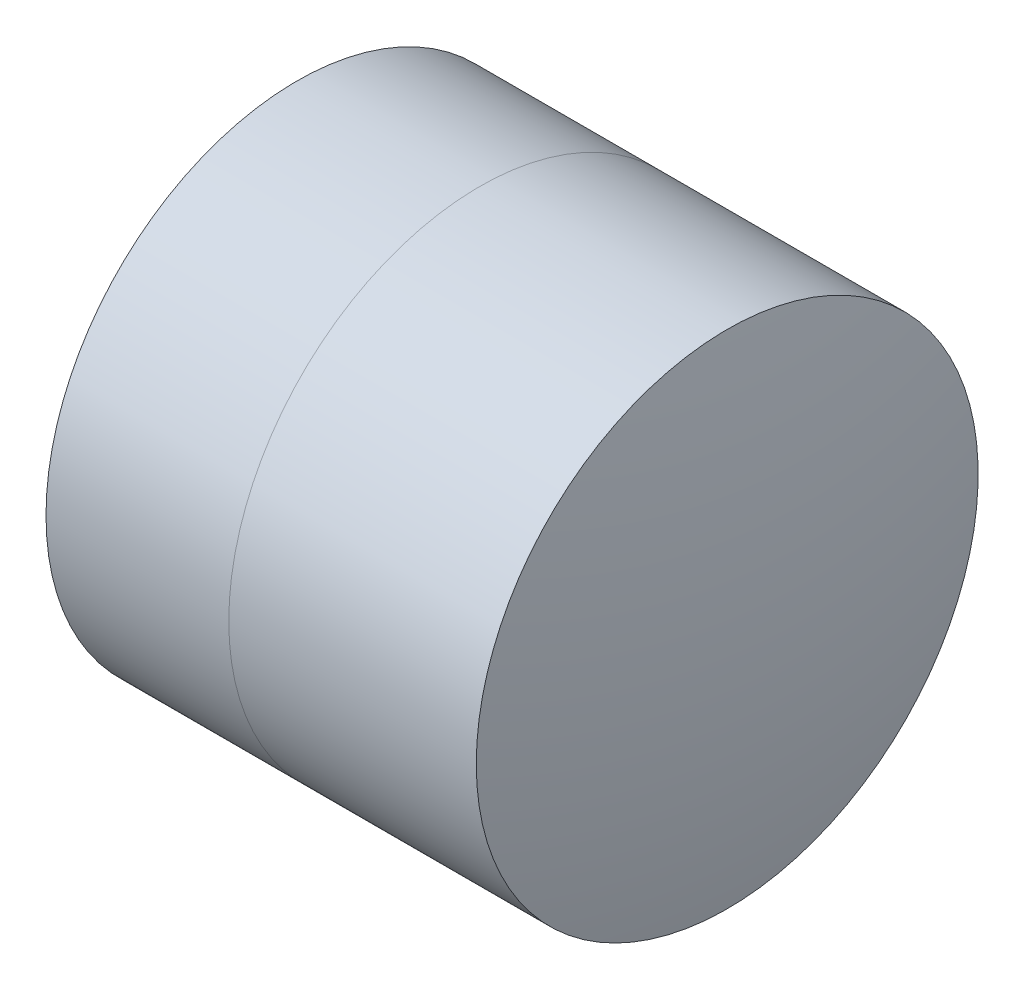
ISO-10303-21;
HEADER;
FILE_DESCRIPTION(('STEP AP214'),'2;1');
FILE_NAME('part.step','',(''),(''),'','','');
FILE_SCHEMA(('AUTOMOTIVE_DESIGN { 1 0 10303 214 1 1 1 1 }'));
ENDSEC;
DATA;
#1=APPLICATION_CONTEXT('core data for automotive mechanical design processes');
#2=APPLICATION_PROTOCOL_DEFINITION('international standard','automotive_design',2000,#1);
#3=PRODUCT_CONTEXT('',#1,'mechanical');
#4=PRODUCT('Part','Part','',(#3));
#5=PRODUCT_RELATED_PRODUCT_CATEGORY('part','',(#4));
#6=PRODUCT_DEFINITION_FORMATION('','',#4);
#7=PRODUCT_DEFINITION_CONTEXT('part definition',#1,'design');
#8=PRODUCT_DEFINITION('design','',#6,#7);
#9=PRODUCT_DEFINITION_SHAPE('','',#8);
#10=(LENGTH_UNIT() NAMED_UNIT(*) SI_UNIT(.MILLI.,.METRE.));
#11=(NAMED_UNIT(*) PLANE_ANGLE_UNIT() SI_UNIT($,.RADIAN.));
#12=(NAMED_UNIT(*) SI_UNIT($,.STERADIAN.) SOLID_ANGLE_UNIT());
#13=UNCERTAINTY_MEASURE_WITH_UNIT(LENGTH_MEASURE(1.E-05),#10,'distance_accuracy_value','');
#14=(GEOMETRIC_REPRESENTATION_CONTEXT(3) GLOBAL_UNCERTAINTY_ASSIGNED_CONTEXT((#13)) GLOBAL_UNIT_ASSIGNED_CONTEXT((#10,
#11,#12)) REPRESENTATION_CONTEXT('',''));
#15=CARTESIAN_POINT('',(0.,0.,0.));
#16=DIRECTION('',(0.,0.,1.));
#17=DIRECTION('',(1.,0.,0.));
#18=AXIS2_PLACEMENT_3D('',#15,#16,#17);
#19=CARTESIAN_POINT('',(-0.604957294480168,0.,0.));
#20=DIRECTION('',(-1.,0.,0.));
#21=DIRECTION('',(0.,0.,1.));
#22=AXIS2_PLACEMENT_3D('',#19,#20,#21);
#23=SPHERICAL_SURFACE('',#22,5.3);
#24=CARTESIAN_POINT('',(4.068371283739,0.,0.));
#25=DIRECTION('',(-1.,0.,0.));
#26=DIRECTION('',(0.,0.,1.));
#27=AXIS2_PLACEMENT_3D('',#24,#25,#26);
#28=CIRCLE('',#27,2.5);
#29=CARTESIAN_POINT('',(4.068371283739,0.,2.5));
#30=VERTEX_POINT('',#29);
#31=EDGE_CURVE('E11',#30,#30,#28,.T.);
#32=ORIENTED_EDGE('',*,*,#31,.T.);
#33=EDGE_LOOP('',(#32));
#34=FACE_BOUND('',#33,.T.);
#35=ADVANCED_FACE('F43',(#34),#23,.F.);
#36=CARTESIAN_POINT('',(-0.551919992657797,0.,0.));
#37=DIRECTION('',(-1.,0.,0.));
#38=DIRECTION('',(0.,0.,1.));
#39=AXIS2_PLACEMENT_3D('',#36,#37,#38);
#40=CYLINDRICAL_SURFACE('',#39,2.5);
#41=CARTESIAN_POINT('',(6.53396157507883,0.,0.));
#42=DIRECTION('',(-1.,0.,0.));
#43=DIRECTION('',(0.,0.,1.));
#44=AXIS2_PLACEMENT_3D('',#41,#42,#43);
#45=CIRCLE('',#44,2.5);
#46=CARTESIAN_POINT('',(6.53396157507883,0.,2.5));
#47=VERTEX_POINT('',#46);
#48=EDGE_CURVE('E49',#47,#47,#45,.T.);
#49=ORIENTED_EDGE('',*,*,#48,.T.);
#50=EDGE_LOOP('',(#49));
#51=FACE_BOUND('',#50,.T.);
#52=ORIENTED_EDGE('',*,*,#31,.F.);
#53=EDGE_LOOP('',(#52));
#54=FACE_BOUND('',#53,.T.);
#55=ADVANCED_FACE('F55',(#51,#54),#40,.T.);
#56=CARTESIAN_POINT('',(-5.30495729448017,0.,0.));
#57=DIRECTION('',(-1.,0.,0.));
#58=DIRECTION('',(0.,0.,1.));
#59=AXIS2_PLACEMENT_3D('',#56,#57,#58);
#60=SPHERICAL_SURFACE('',#59,12.1);
#61=ORIENTED_EDGE('',*,*,#48,.F.);
#62=EDGE_LOOP('',(#61));
#63=FACE_BOUND('',#62,.T.);
#64=ADVANCED_FACE('F58',(#63),#60,.T.);
#65=CLOSED_SHELL('',(#35,#55,#64));
#66=MANIFOLD_SOLID_BREP('B2',#65);
#67=CARTESIAN_POINT('',(14.4950427055198,0.,0.));
#68=DIRECTION('',(-1.,0.,0.));
#69=DIRECTION('',(0.,0.,1.));
#70=AXIS2_PLACEMENT_3D('',#67,#68,#69);
#71=SPHERICAL_SURFACE('',#70,12.5);
#72=CARTESIAN_POINT('',(2.24759399160394,0.,0.));
#73=DIRECTION('',(-1.,0.,0.));
#74=DIRECTION('',(0.,0.,1.));
#75=AXIS2_PLACEMENT_3D('',#72,#73,#74);
#76=CIRCLE('',#75,2.5);
#77=CARTESIAN_POINT('',(2.24759399160394,0.,2.5));
#78=VERTEX_POINT('',#77);
#79=EDGE_CURVE('E42',#78,#78,#76,.T.);
#80=ORIENTED_EDGE('',*,*,#79,.T.);
#81=EDGE_LOOP('',(#80));
#82=FACE_BOUND('',#81,.T.);
#83=ADVANCED_FACE('F84',(#82),#71,.T.);
#84=CARTESIAN_POINT('',(-0.816062176165804,0.,0.));
#85=DIRECTION('',(-1.,0.,0.));
#86=DIRECTION('',(0.,0.,1.));
#87=AXIS2_PLACEMENT_3D('',#84,#85,#86);
#88=CYLINDRICAL_SURFACE('',#87,2.5);
#89=CARTESIAN_POINT('',(4.068371283739,0.,0.));
#90=DIRECTION('',(-1.,0.,0.));
#91=DIRECTION('',(0.,0.,1.));
#92=AXIS2_PLACEMENT_3D('',#89,#90,#91);
#93=CIRCLE('',#92,2.5);
#94=CARTESIAN_POINT('',(4.068371283739,0.,2.5));
#95=VERTEX_POINT('',#94);
#96=EDGE_CURVE('E90',#95,#95,#93,.T.);
#97=ORIENTED_EDGE('',*,*,#96,.T.);
#98=EDGE_LOOP('',(#97));
#99=FACE_BOUND('',#98,.T.);
#100=ORIENTED_EDGE('',*,*,#79,.F.);
#101=EDGE_LOOP('',(#100));
#102=FACE_BOUND('',#101,.T.);
#103=ADVANCED_FACE('F96',(#99,#102),#88,.T.);
#104=CARTESIAN_POINT('',(-0.604957294480168,0.,0.));
#105=DIRECTION('',(-1.,0.,0.));
#106=DIRECTION('',(0.,0.,1.));
#107=AXIS2_PLACEMENT_3D('',#104,#105,#106);
#108=SPHERICAL_SURFACE('',#107,5.3);
#109=ORIENTED_EDGE('',*,*,#96,.F.);
#110=EDGE_LOOP('',(#109));
#111=FACE_BOUND('',#110,.T.);
#112=ADVANCED_FACE('F99',(#111),#108,.T.);
#113=CLOSED_SHELL('',(#83,#103,#112));
#114=MANIFOLD_SOLID_BREP('B6',#113);
#115=ADVANCED_BREP_SHAPE_REPRESENTATION('',(#18,#66,#114),#14);
#116=SHAPE_DEFINITION_REPRESENTATION(#9,#115);
ENDSEC;
END-ISO-10303-21;
